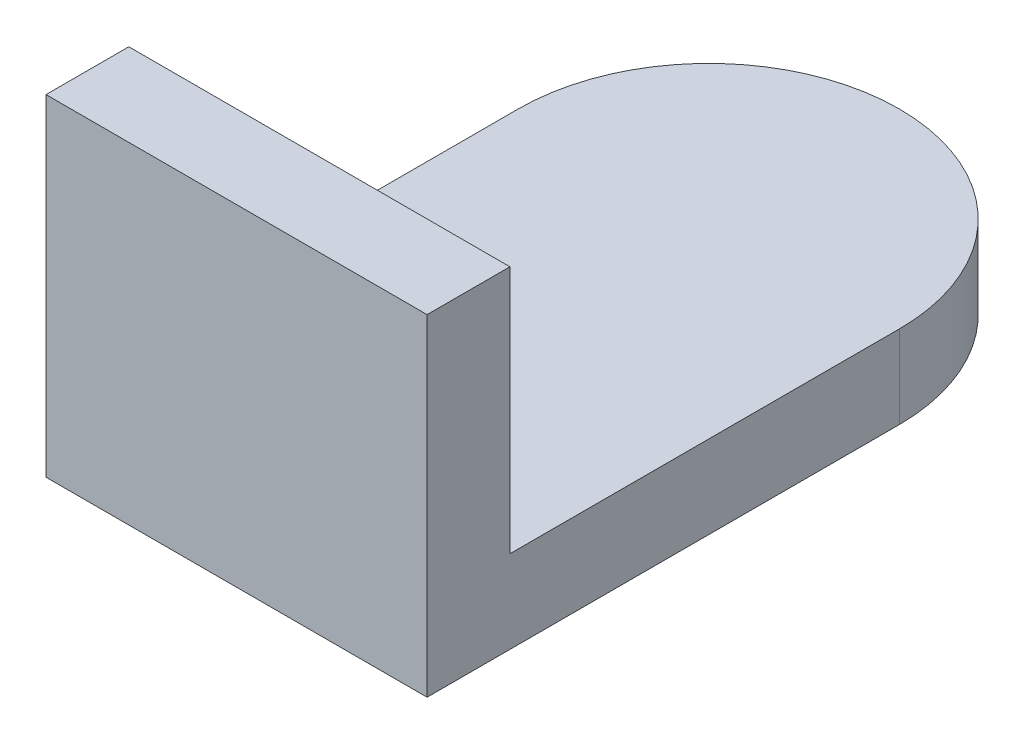
ISO-10303-21;
HEADER;
FILE_DESCRIPTION(('STEP AP214'),'2;1');
FILE_NAME('part.step','',(''),(''),'','','');
FILE_SCHEMA(('AUTOMOTIVE_DESIGN { 1 0 10303 214 1 1 1 1 }'));
ENDSEC;
DATA;
#1=APPLICATION_CONTEXT('core data for automotive mechanical design processes');
#2=APPLICATION_PROTOCOL_DEFINITION('international standard','automotive_design',2000,#1);
#3=PRODUCT_CONTEXT('',#1,'mechanical');
#4=PRODUCT('Part','Part','',(#3));
#5=PRODUCT_RELATED_PRODUCT_CATEGORY('part','',(#4));
#6=PRODUCT_DEFINITION_FORMATION('','',#4);
#7=PRODUCT_DEFINITION_CONTEXT('part definition',#1,'design');
#8=PRODUCT_DEFINITION('design','',#6,#7);
#9=PRODUCT_DEFINITION_SHAPE('','',#8);
#10=(LENGTH_UNIT() NAMED_UNIT(*) SI_UNIT(.MILLI.,.METRE.));
#11=(NAMED_UNIT(*) PLANE_ANGLE_UNIT() SI_UNIT($,.RADIAN.));
#12=(NAMED_UNIT(*) SI_UNIT($,.STERADIAN.) SOLID_ANGLE_UNIT());
#13=UNCERTAINTY_MEASURE_WITH_UNIT(LENGTH_MEASURE(1.E-05),#10,'distance_accuracy_value','');
#14=(GEOMETRIC_REPRESENTATION_CONTEXT(3) GLOBAL_UNCERTAINTY_ASSIGNED_CONTEXT((#13)) GLOBAL_UNIT_ASSIGNED_CONTEXT((#10,
#11,#12)) REPRESENTATION_CONTEXT('',''));
#15=CARTESIAN_POINT('',(0.,0.,0.));
#16=DIRECTION('',(0.,0.,1.));
#17=DIRECTION('',(1.,0.,0.));
#18=AXIS2_PLACEMENT_3D('',#15,#16,#17);
#19=CARTESIAN_POINT('',(0.,0.,1.45));
#20=DIRECTION('',(0.,0.,-1.));
#21=DIRECTION('',(-1.,0.,0.));
#22=AXIS2_PLACEMENT_3D('',#19,#20,#21);
#23=PLANE('',#22);
#24=DIRECTION('',(0.,1.,0.));
#25=VECTOR('',#24,1.);
#26=CARTESIAN_POINT('',(-0.135,-0.2,1.45));
#27=LINE('',#26,#25);
#28=CARTESIAN_POINT('',(-0.135,-0.35,1.45));
#29=VERTEX_POINT('',#28);
#30=CARTESIAN_POINT('',(-0.135,-0.2,1.45));
#31=VERTEX_POINT('',#30);
#32=EDGE_CURVE('E11',#29,#31,#27,.T.);
#33=ORIENTED_EDGE('',*,*,#32,.F.);
#34=DIRECTION('',(-1.,0.,0.));
#35=VECTOR('',#34,1.);
#36=CARTESIAN_POINT('',(-0.365,-0.35,1.45));
#37=LINE('',#36,#35);
#38=CARTESIAN_POINT('',(-0.365,-0.35,1.45));
#39=VERTEX_POINT('',#38);
#40=EDGE_CURVE('E24',#29,#39,#37,.T.);
#41=ORIENTED_EDGE('',*,*,#40,.T.);
#42=DIRECTION('',(0.,-1.,0.));
#43=VECTOR('',#42,1.);
#44=CARTESIAN_POINT('',(-0.365,-0.2,1.45));
#45=LINE('',#44,#43);
#46=CARTESIAN_POINT('',(-0.365,-0.2,1.45));
#47=VERTEX_POINT('',#46);
#48=EDGE_CURVE('E74',#47,#39,#45,.T.);
#49=ORIENTED_EDGE('',*,*,#48,.F.);
#50=DIRECTION('',(-1.,0.,0.));
#51=VECTOR('',#50,1.);
#52=CARTESIAN_POINT('',(-0.365,-0.2,1.45));
#53=LINE('',#52,#51);
#54=EDGE_CURVE('E117',#31,#47,#53,.T.);
#55=ORIENTED_EDGE('',*,*,#54,.F.);
#56=EDGE_LOOP('',(#33,#41,#49,#55));
#57=FACE_BOUND('',#56,.T.);
#58=ADVANCED_FACE('F17',(#57),#23,.T.);
#59=CARTESIAN_POINT('',(-0.365,-0.2,1.45));
#60=DIRECTION('',(0.,1.,0.));
#61=DIRECTION('',(-1.,0.,0.));
#62=AXIS2_PLACEMENT_3D('',#59,#60,#61);
#63=PLANE('',#62);
#64=DIRECTION('',(-1.,0.,0.));
#65=VECTOR('',#64,1.);
#66=CARTESIAN_POINT('',(-0.365,-0.2,1.5));
#67=LINE('',#66,#65);
#68=CARTESIAN_POINT('',(-0.135,-0.2,1.5));
#69=VERTEX_POINT('',#68);
#70=CARTESIAN_POINT('',(-0.365,-0.2,1.5));
#71=VERTEX_POINT('',#70);
#72=EDGE_CURVE('E115',#69,#71,#67,.T.);
#73=ORIENTED_EDGE('',*,*,#72,.F.);
#74=DIRECTION('',(0.,0.,1.));
#75=VECTOR('',#74,1.);
#76=CARTESIAN_POINT('',(-0.135,-0.2,1.45));
#77=LINE('',#76,#75);
#78=EDGE_CURVE('E113',#31,#69,#77,.T.);
#79=ORIENTED_EDGE('',*,*,#78,.F.);
#80=ORIENTED_EDGE('',*,*,#54,.T.);
#81=DIRECTION('',(0.,0.,1.));
#82=VECTOR('',#81,1.);
#83=CARTESIAN_POINT('',(-0.365,-0.2,1.45));
#84=LINE('',#83,#82);
#85=EDGE_CURVE('E110',#47,#71,#84,.T.);
#86=ORIENTED_EDGE('',*,*,#85,.T.);
#87=EDGE_LOOP('',(#73,#79,#80,#86));
#88=FACE_BOUND('',#87,.T.);
#89=ADVANCED_FACE('F127',(#88),#63,.T.);
#90=CARTESIAN_POINT('',(-0.135,-0.2,1.45));
#91=DIRECTION('',(1.,0.,0.));
#92=DIRECTION('',(0.,0.,-1.));
#93=AXIS2_PLACEMENT_3D('',#90,#91,#92);
#94=PLANE('',#93);
#95=DIRECTION('',(0.,1.,0.));
#96=VECTOR('',#95,1.);
#97=CARTESIAN_POINT('',(-0.135,-0.2,1.5));
#98=LINE('',#97,#96);
#99=CARTESIAN_POINT('',(-0.135,-0.4,1.5));
#100=VERTEX_POINT('',#99);
#101=EDGE_CURVE('E107',#100,#69,#98,.T.);
#102=ORIENTED_EDGE('',*,*,#101,.F.);
#103=DIRECTION('',(0.,0.,1.));
#104=VECTOR('',#103,1.);
#105=CARTESIAN_POINT('',(-0.135,-0.4,1.45));
#106=LINE('',#105,#104);
#107=CARTESIAN_POINT('',(-0.135,-0.4,1.215));
#108=VERTEX_POINT('',#107);
#109=EDGE_CURVE('E104',#108,#100,#106,.T.);
#110=ORIENTED_EDGE('',*,*,#109,.F.);
#111=DIRECTION('',(0.,-1.,0.));
#112=VECTOR('',#111,1.);
#113=CARTESIAN_POINT('',(-0.135,-0.35,1.215));
#114=LINE('',#113,#112);
#115=CARTESIAN_POINT('',(-0.135,-0.35,1.215));
#116=VERTEX_POINT('',#115);
#117=EDGE_CURVE('E102',#116,#108,#114,.T.);
#118=ORIENTED_EDGE('',*,*,#117,.F.);
#119=DIRECTION('',(0.,0.,1.));
#120=VECTOR('',#119,1.);
#121=CARTESIAN_POINT('',(-0.135,-0.35,1.45));
#122=LINE('',#121,#120);
#123=EDGE_CURVE('E90',#116,#29,#122,.T.);
#124=ORIENTED_EDGE('',*,*,#123,.T.);
#125=ORIENTED_EDGE('',*,*,#32,.T.);
#126=ORIENTED_EDGE('',*,*,#78,.T.);
#127=EDGE_LOOP('',(#102,#110,#118,#124,#125,#126));
#128=FACE_BOUND('',#127,.T.);
#129=ADVANCED_FACE('F120',(#128),#94,.T.);
#130=CARTESIAN_POINT('',(-0.365,-0.4,1.45));
#131=DIRECTION('',(0.,-1.,0.));
#132=DIRECTION('',(1.,0.,0.));
#133=AXIS2_PLACEMENT_3D('',#130,#131,#132);
#134=PLANE('',#133);
#135=DIRECTION('',(1.,0.,0.));
#136=VECTOR('',#135,1.);
#137=CARTESIAN_POINT('',(-0.365,-0.4,1.5));
#138=LINE('',#137,#136);
#139=CARTESIAN_POINT('',(-0.365,-0.4,1.5));
#140=VERTEX_POINT('',#139);
#141=EDGE_CURVE('E98',#140,#100,#138,.T.);
#142=ORIENTED_EDGE('',*,*,#141,.F.);
#143=DIRECTION('',(0.,0.,1.));
#144=VECTOR('',#143,1.);
#145=CARTESIAN_POINT('',(-0.365,-0.4,1.45));
#146=LINE('',#145,#144);
#147=CARTESIAN_POINT('',(-0.365,-0.4,1.215));
#148=VERTEX_POINT('',#147);
#149=EDGE_CURVE('E96',#148,#140,#146,.T.);
#150=ORIENTED_EDGE('',*,*,#149,.F.);
#151=CARTESIAN_POINT('',(-0.25,-0.4,1.215));
#152=DIRECTION('',(0.,-1.,0.));
#153=DIRECTION('',(1.,0.,0.));
#154=AXIS2_PLACEMENT_3D('',#151,#152,#153);
#155=CIRCLE('',#154,0.115);
#156=EDGE_CURVE('E86',#148,#108,#155,.T.);
#157=ORIENTED_EDGE('',*,*,#156,.T.);
#158=ORIENTED_EDGE('',*,*,#109,.T.);
#159=EDGE_LOOP('',(#142,#150,#157,#158));
#160=FACE_BOUND('',#159,.T.);
#161=ADVANCED_FACE('F122',(#160),#134,.T.);
#162=CARTESIAN_POINT('',(-0.365,-0.2,1.45));
#163=DIRECTION('',(-1.,0.,0.));
#164=DIRECTION('',(0.,0.,1.));
#165=AXIS2_PLACEMENT_3D('',#162,#163,#164);
#166=PLANE('',#165);
#167=DIRECTION('',(0.,-1.,0.));
#168=VECTOR('',#167,1.);
#169=CARTESIAN_POINT('',(-0.365,-0.2,1.5));
#170=LINE('',#169,#168);
#171=EDGE_CURVE('E77',#71,#140,#170,.T.);
#172=ORIENTED_EDGE('',*,*,#171,.F.);
#173=ORIENTED_EDGE('',*,*,#85,.F.);
#174=ORIENTED_EDGE('',*,*,#48,.T.);
#175=DIRECTION('',(0.,0.,-1.));
#176=VECTOR('',#175,1.);
#177=CARTESIAN_POINT('',(-0.365,-0.35,1.45));
#178=LINE('',#177,#176);
#179=CARTESIAN_POINT('',(-0.365,-0.35,1.215));
#180=VERTEX_POINT('',#179);
#181=EDGE_CURVE('E67',#39,#180,#178,.T.);
#182=ORIENTED_EDGE('',*,*,#181,.T.);
#183=DIRECTION('',(0.,-1.,0.));
#184=VECTOR('',#183,1.);
#185=CARTESIAN_POINT('',(-0.365,-0.35,1.215));
#186=LINE('',#185,#184);
#187=EDGE_CURVE('E72',#180,#148,#186,.T.);
#188=ORIENTED_EDGE('',*,*,#187,.T.);
#189=ORIENTED_EDGE('',*,*,#149,.T.);
#190=EDGE_LOOP('',(#172,#173,#174,#182,#188,#189));
#191=FACE_BOUND('',#190,.T.);
#192=ADVANCED_FACE('F70',(#191),#166,.T.);
#193=CARTESIAN_POINT('',(0.,0.,1.5));
#194=DIRECTION('',(0.,0.,-1.));
#195=DIRECTION('',(-1.,0.,0.));
#196=AXIS2_PLACEMENT_3D('',#193,#194,#195);
#197=PLANE('',#196);
#198=ORIENTED_EDGE('',*,*,#72,.T.);
#199=ORIENTED_EDGE('',*,*,#171,.T.);
#200=ORIENTED_EDGE('',*,*,#141,.T.);
#201=ORIENTED_EDGE('',*,*,#101,.T.);
#202=EDGE_LOOP('',(#198,#199,#200,#201));
#203=FACE_BOUND('',#202,.T.);
#204=ADVANCED_FACE('F124',(#203),#197,.F.);
#205=CARTESIAN_POINT('',(-0.25,-0.35,1.215));
#206=DIRECTION('',(0.,-1.,0.));
#207=DIRECTION('',(1.,0.,0.));
#208=AXIS2_PLACEMENT_3D('',#205,#206,#207);
#209=CYLINDRICAL_SURFACE('',#208,0.115);
#210=ORIENTED_EDGE('',*,*,#156,.F.);
#211=ORIENTED_EDGE('',*,*,#187,.F.);
#212=CARTESIAN_POINT('',(-0.25,-0.35,1.215));
#213=DIRECTION('',(0.,-1.,0.));
#214=DIRECTION('',(1.,0.,0.));
#215=AXIS2_PLACEMENT_3D('',#212,#213,#214);
#216=CIRCLE('',#215,0.115);
#217=EDGE_CURVE('E84',#180,#116,#216,.T.);
#218=ORIENTED_EDGE('',*,*,#217,.T.);
#219=ORIENTED_EDGE('',*,*,#117,.T.);
#220=EDGE_LOOP('',(#210,#211,#218,#219));
#221=FACE_BOUND('',#220,.T.);
#222=ADVANCED_FACE('F82',(#221),#209,.T.);
#223=CARTESIAN_POINT('',(-0.25,-0.35,1.215));
#224=DIRECTION('',(0.,-1.,0.));
#225=DIRECTION('',(1.,0.,0.));
#226=AXIS2_PLACEMENT_3D('',#223,#224,#225);
#227=PLANE('',#226);
#228=ORIENTED_EDGE('',*,*,#181,.F.);
#229=ORIENTED_EDGE('',*,*,#40,.F.);
#230=ORIENTED_EDGE('',*,*,#123,.F.);
#231=ORIENTED_EDGE('',*,*,#217,.F.);
#232=EDGE_LOOP('',(#228,#229,#230,#231));
#233=FACE_BOUND('',#232,.T.);
#234=ADVANCED_FACE('F89',(#233),#227,.F.);
#235=CLOSED_SHELL('',(#58,#89,#129,#161,#192,#204,#222,#234));
#236=MANIFOLD_SOLID_BREP('B1',#235);
#237=ADVANCED_BREP_SHAPE_REPRESENTATION('',(#18,#236),#14);
#238=SHAPE_DEFINITION_REPRESENTATION(#9,#237);
ENDSEC;
END-ISO-10303-21;
